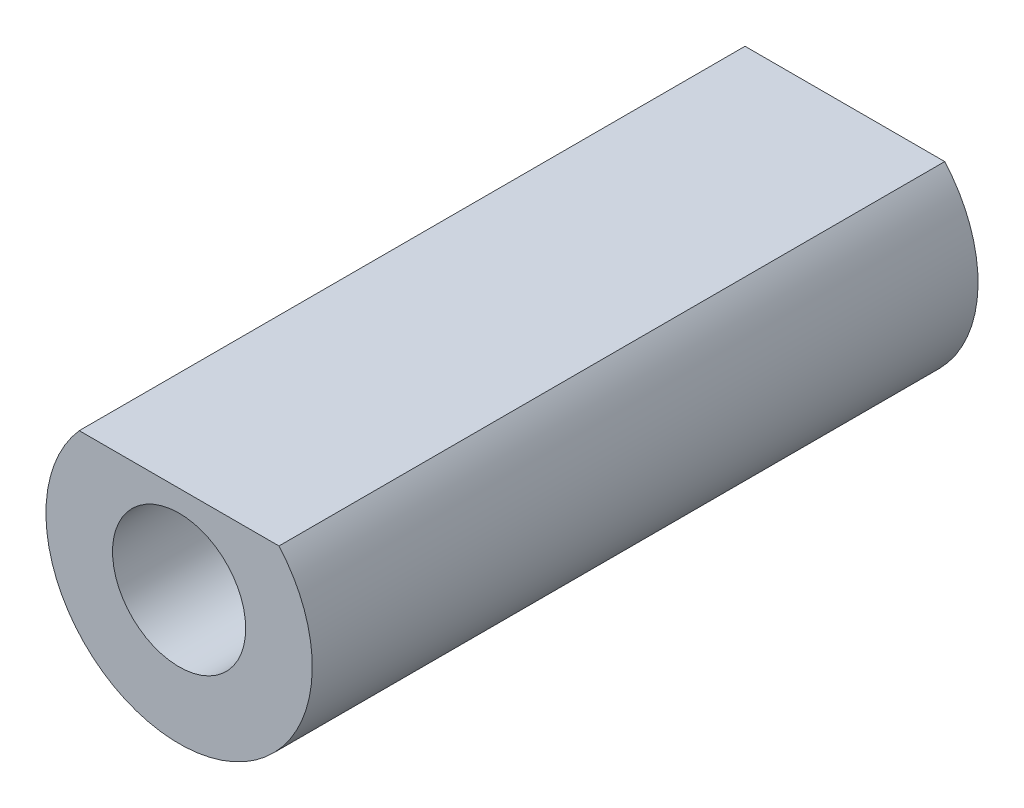
ISO-10303-21;
HEADER;
FILE_DESCRIPTION(('STEP AP214'),'2;1');
FILE_NAME('part.step','',(''),(''),'','','');
FILE_SCHEMA(('AUTOMOTIVE_DESIGN { 1 0 10303 214 1 1 1 1 }'));
ENDSEC;
DATA;
#1=APPLICATION_CONTEXT('core data for automotive mechanical design processes');
#2=APPLICATION_PROTOCOL_DEFINITION('international standard','automotive_design',2000,#1);
#3=PRODUCT_CONTEXT('',#1,'mechanical');
#4=PRODUCT('Part','Part','',(#3));
#5=PRODUCT_RELATED_PRODUCT_CATEGORY('part','',(#4));
#6=PRODUCT_DEFINITION_FORMATION('','',#4);
#7=PRODUCT_DEFINITION_CONTEXT('part definition',#1,'design');
#8=PRODUCT_DEFINITION('design','',#6,#7);
#9=PRODUCT_DEFINITION_SHAPE('','',#8);
#10=(LENGTH_UNIT() NAMED_UNIT(*) SI_UNIT(.MILLI.,.METRE.));
#11=(NAMED_UNIT(*) PLANE_ANGLE_UNIT() SI_UNIT($,.RADIAN.));
#12=(NAMED_UNIT(*) SI_UNIT($,.STERADIAN.) SOLID_ANGLE_UNIT());
#13=UNCERTAINTY_MEASURE_WITH_UNIT(LENGTH_MEASURE(1.E-05),#10,'distance_accuracy_value','');
#14=(GEOMETRIC_REPRESENTATION_CONTEXT(3) GLOBAL_UNCERTAINTY_ASSIGNED_CONTEXT((#13)) GLOBAL_UNIT_ASSIGNED_CONTEXT((#10,
#11,#12)) REPRESENTATION_CONTEXT('',''));
#15=CARTESIAN_POINT('',(0.,0.,0.));
#16=DIRECTION('',(0.,0.,1.));
#17=DIRECTION('',(1.,0.,0.));
#18=AXIS2_PLACEMENT_3D('',#15,#16,#17);
#19=CARTESIAN_POINT('',(-2.,0.,0.));
#20=DIRECTION('',(0.,0.,-1.));
#21=DIRECTION('',(-1.,0.,0.));
#22=AXIS2_PLACEMENT_3D('',#19,#20,#21);
#23=PLANE('',#22);
#24=CARTESIAN_POINT('',(0.,0.,0.));
#25=DIRECTION('',(0.,0.,1.));
#26=DIRECTION('',(1.,0.,0.));
#27=AXIS2_PLACEMENT_3D('',#24,#25,#26);
#28=CIRCLE('',#27,1.);
#29=CARTESIAN_POINT('',(1.,0.,0.));
#30=VERTEX_POINT('',#29);
#31=EDGE_CURVE('E11',#30,#30,#28,.T.);
#32=ORIENTED_EDGE('',*,*,#31,.F.);
#33=EDGE_LOOP('',(#32));
#34=FACE_BOUND('',#33,.T.);
#35=CARTESIAN_POINT('',(0.,0.,0.));
#36=DIRECTION('',(0.,0.,1.));
#37=DIRECTION('',(1.,0.,0.));
#38=AXIS2_PLACEMENT_3D('',#35,#36,#37);
#39=CIRCLE('',#38,2.);
#40=CARTESIAN_POINT('',(-1.5,1.32287565553229,0.));
#41=VERTEX_POINT('',#40);
#42=CARTESIAN_POINT('',(1.5,1.32287565553229,0.));
#43=VERTEX_POINT('',#42);
#44=EDGE_CURVE('E75',#41,#43,#39,.T.);
#45=ORIENTED_EDGE('',*,*,#44,.T.);
#46=DIRECTION('',(1.,0.,0.));
#47=VECTOR('',#46,1.);
#48=CARTESIAN_POINT('',(-1.5,1.32287565553229,0.));
#49=LINE('',#48,#47);
#50=EDGE_CURVE('E66',#41,#43,#49,.T.);
#51=ORIENTED_EDGE('',*,*,#50,.F.);
#52=EDGE_LOOP('',(#45,#51));
#53=FACE_BOUND('',#52,.T.);
#54=ADVANCED_FACE('F39',(#34,#53),#23,.F.);
#55=CARTESIAN_POINT('',(0.,0.,0.));
#56=DIRECTION('',(0.,0.,1.));
#57=DIRECTION('',(1.,0.,0.));
#58=AXIS2_PLACEMENT_3D('',#55,#56,#57);
#59=CYLINDRICAL_SURFACE('',#58,1.);
#60=CARTESIAN_POINT('',(0.,0.,-10.));
#61=DIRECTION('',(0.,0.,1.));
#62=DIRECTION('',(1.,0.,0.));
#63=AXIS2_PLACEMENT_3D('',#60,#61,#62);
#64=CIRCLE('',#63,1.);
#65=CARTESIAN_POINT('',(1.,0.,-10.));
#66=VERTEX_POINT('',#65);
#67=EDGE_CURVE('E47',#66,#66,#64,.T.);
#68=ORIENTED_EDGE('',*,*,#67,.F.);
#69=EDGE_LOOP('',(#68));
#70=FACE_BOUND('',#69,.T.);
#71=ORIENTED_EDGE('',*,*,#31,.T.);
#72=EDGE_LOOP('',(#71));
#73=FACE_BOUND('',#72,.T.);
#74=ADVANCED_FACE('F92',(#70,#73),#59,.F.);
#75=CARTESIAN_POINT('',(-1.,0.,-10.));
#76=DIRECTION('',(0.,0.,1.));
#77=DIRECTION('',(1.,0.,0.));
#78=AXIS2_PLACEMENT_3D('',#75,#76,#77);
#79=PLANE('',#78);
#80=CARTESIAN_POINT('',(0.,0.,-10.));
#81=DIRECTION('',(0.,0.,1.));
#82=DIRECTION('',(1.,0.,0.));
#83=AXIS2_PLACEMENT_3D('',#80,#81,#82);
#84=CIRCLE('',#83,2.);
#85=CARTESIAN_POINT('',(-1.5,1.32287565553229,-10.));
#86=VERTEX_POINT('',#85);
#87=CARTESIAN_POINT('',(1.5,1.32287565553229,-10.));
#88=VERTEX_POINT('',#87);
#89=EDGE_CURVE('E80',#86,#88,#84,.T.);
#90=ORIENTED_EDGE('',*,*,#89,.F.);
#91=DIRECTION('',(1.,0.,0.));
#92=VECTOR('',#91,1.);
#93=CARTESIAN_POINT('',(-1.5,1.32287565553229,-10.));
#94=LINE('',#93,#92);
#95=EDGE_CURVE('E54',#86,#88,#94,.T.);
#96=ORIENTED_EDGE('',*,*,#95,.T.);
#97=EDGE_LOOP('',(#90,#96));
#98=FACE_BOUND('',#97,.T.);
#99=ORIENTED_EDGE('',*,*,#67,.T.);
#100=EDGE_LOOP('',(#99));
#101=FACE_BOUND('',#100,.T.);
#102=ADVANCED_FACE('F90',(#98,#101),#79,.F.);
#103=CARTESIAN_POINT('',(0.,0.,0.));
#104=DIRECTION('',(0.,0.,1.));
#105=DIRECTION('',(1.,0.,0.));
#106=AXIS2_PLACEMENT_3D('',#103,#104,#105);
#107=CYLINDRICAL_SURFACE('',#106,2.);
#108=ORIENTED_EDGE('',*,*,#89,.T.);
#109=DIRECTION('',(0.,0.,1.));
#110=VECTOR('',#109,1.);
#111=CARTESIAN_POINT('',(1.5,1.32287565553229,-10.));
#112=LINE('',#111,#110);
#113=EDGE_CURVE('E60',#88,#43,#112,.T.);
#114=ORIENTED_EDGE('',*,*,#113,.T.);
#115=ORIENTED_EDGE('',*,*,#44,.F.);
#116=DIRECTION('',(0.,0.,1.));
#117=VECTOR('',#116,1.);
#118=CARTESIAN_POINT('',(-1.5,1.32287565553229,-10.));
#119=LINE('',#118,#117);
#120=EDGE_CURVE('E63',#86,#41,#119,.T.);
#121=ORIENTED_EDGE('',*,*,#120,.F.);
#122=EDGE_LOOP('',(#108,#114,#115,#121));
#123=FACE_BOUND('',#122,.T.);
#124=ADVANCED_FACE('F78',(#123),#107,.T.);
#125=CARTESIAN_POINT('',(-1.5,1.32287565553229,-10.));
#126=DIRECTION('',(0.,-1.,0.));
#127=DIRECTION('',(0.,0.,-1.));
#128=AXIS2_PLACEMENT_3D('',#125,#126,#127);
#129=PLANE('',#128);
#130=ORIENTED_EDGE('',*,*,#50,.T.);
#131=ORIENTED_EDGE('',*,*,#113,.F.);
#132=ORIENTED_EDGE('',*,*,#95,.F.);
#133=ORIENTED_EDGE('',*,*,#120,.T.);
#134=EDGE_LOOP('',(#130,#131,#132,#133));
#135=FACE_BOUND('',#134,.T.);
#136=ADVANCED_FACE('F65',(#135),#129,.F.);
#137=CLOSED_SHELL('',(#54,#74,#102,#124,#136));
#138=MANIFOLD_SOLID_BREP('B2',#137);
#139=ADVANCED_BREP_SHAPE_REPRESENTATION('',(#18,#138),#14);
#140=SHAPE_DEFINITION_REPRESENTATION(#9,#139);
ENDSEC;
END-ISO-10303-21;
